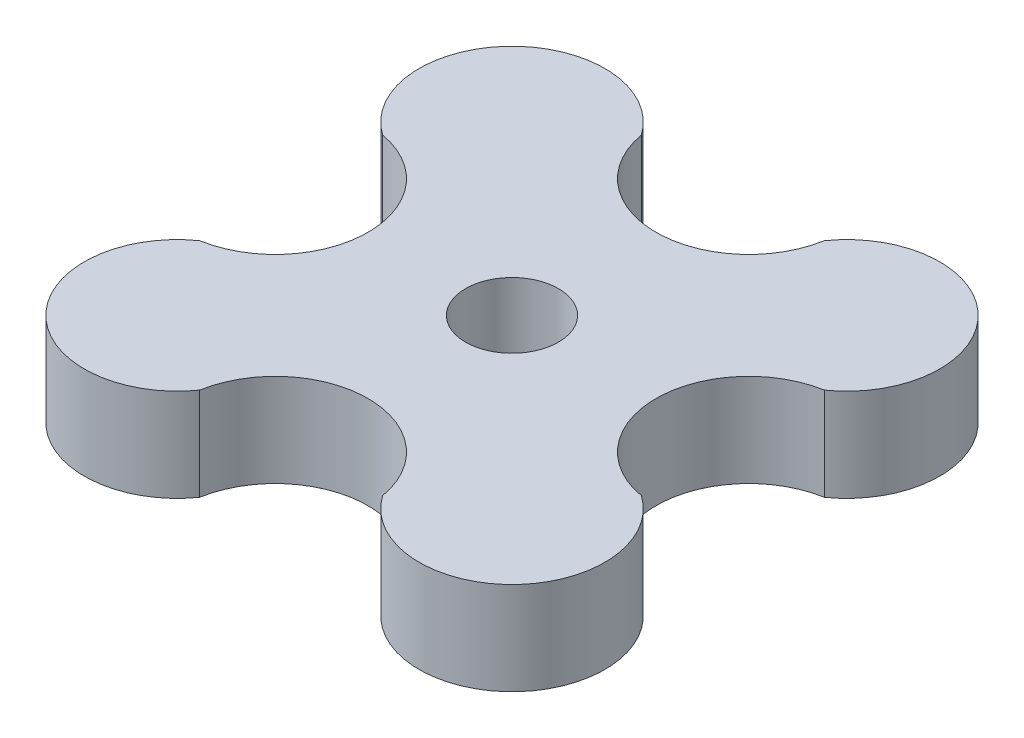
ISO-10303-21;
HEADER;
FILE_DESCRIPTION(('STEP AP214'),'2;1');
FILE_NAME('part.step','',(''),(''),'','','');
FILE_SCHEMA(('AUTOMOTIVE_DESIGN { 1 0 10303 214 1 1 1 1 }'));
ENDSEC;
DATA;
#1=APPLICATION_CONTEXT('core data for automotive mechanical design processes');
#2=APPLICATION_PROTOCOL_DEFINITION('international standard','automotive_design',2000,#1);
#3=PRODUCT_CONTEXT('',#1,'mechanical');
#4=PRODUCT('Part','Part','',(#3));
#5=PRODUCT_RELATED_PRODUCT_CATEGORY('part','',(#4));
#6=PRODUCT_DEFINITION_FORMATION('','',#4);
#7=PRODUCT_DEFINITION_CONTEXT('part definition',#1,'design');
#8=PRODUCT_DEFINITION('design','',#6,#7);
#9=PRODUCT_DEFINITION_SHAPE('','',#8);
#10=(LENGTH_UNIT() NAMED_UNIT(*) SI_UNIT(.MILLI.,.METRE.));
#11=(NAMED_UNIT(*) PLANE_ANGLE_UNIT() SI_UNIT($,.RADIAN.));
#12=(NAMED_UNIT(*) SI_UNIT($,.STERADIAN.) SOLID_ANGLE_UNIT());
#13=UNCERTAINTY_MEASURE_WITH_UNIT(LENGTH_MEASURE(1.E-05),#10,'distance_accuracy_value','');
#14=(GEOMETRIC_REPRESENTATION_CONTEXT(3) GLOBAL_UNCERTAINTY_ASSIGNED_CONTEXT((#13)) GLOBAL_UNIT_ASSIGNED_CONTEXT((#10,
#11,#12)) REPRESENTATION_CONTEXT('',''));
#15=CARTESIAN_POINT('',(0.,0.,0.));
#16=DIRECTION('',(0.,0.,1.));
#17=DIRECTION('',(1.,0.,0.));
#18=AXIS2_PLACEMENT_3D('',#15,#16,#17);
#19=CARTESIAN_POINT('',(0.,5.,-12.75));
#20=DIRECTION('',(0.,-1.,0.));
#21=DIRECTION('',(0.,0.,-1.));
#22=AXIS2_PLACEMENT_3D('',#19,#20,#21);
#23=CYLINDRICAL_SURFACE('',#22,5.);
#24=CARTESIAN_POINT('',(0.,0.,-12.75));
#25=DIRECTION('',(0.,1.,0.));
#26=DIRECTION('',(0.,0.,1.));
#27=AXIS2_PLACEMENT_3D('',#24,#25,#26);
#28=CIRCLE('',#27,5.);
#29=CARTESIAN_POINT('',(-4.9258377784617,0.,-11.8920243708126));
#30=VERTEX_POINT('',#29);
#31=CARTESIAN_POINT('',(4.92583777846162,0.,-11.8920243708121));
#32=VERTEX_POINT('',#31);
#33=EDGE_CURVE('E138',#30,#32,#28,.T.);
#34=ORIENTED_EDGE('',*,*,#33,.F.);
#35=DIRECTION('',(0.,-1.,0.));
#36=VECTOR('',#35,1.);
#37=CARTESIAN_POINT('',(-4.9258377784617,5.,-11.8920243708126));
#38=LINE('',#37,#36);
#39=CARTESIAN_POINT('',(-4.9258377784617,5.,-11.8920243708126));
#40=VERTEX_POINT('',#39);
#41=EDGE_CURVE('E11',#40,#30,#38,.T.);
#42=ORIENTED_EDGE('',*,*,#41,.F.);
#43=CARTESIAN_POINT('',(0.,5.,-12.75));
#44=DIRECTION('',(0.,1.,0.));
#45=DIRECTION('',(0.,0.,1.));
#46=AXIS2_PLACEMENT_3D('',#43,#44,#45);
#47=CIRCLE('',#46,5.);
#48=CARTESIAN_POINT('',(4.92583777846162,5.,-11.8920243708121));
#49=VERTEX_POINT('',#48);
#50=EDGE_CURVE('E159',#40,#49,#47,.T.);
#51=ORIENTED_EDGE('',*,*,#50,.T.);
#52=DIRECTION('',(0.,-1.,0.));
#53=VECTOR('',#52,1.);
#54=CARTESIAN_POINT('',(4.92583777846162,5.,-11.8920243708121));
#55=LINE('',#54,#53);
#56=EDGE_CURVE('E95',#49,#32,#55,.T.);
#57=ORIENTED_EDGE('',*,*,#56,.T.);
#58=EDGE_LOOP('',(#34,#42,#51,#57));
#59=FACE_BOUND('',#58,.T.);
#60=ADVANCED_FACE('F45',(#59),#23,.F.);
#61=CARTESIAN_POINT('',(-9.01561146012822,5.,-9.01561146012784));
#62=DIRECTION('',(0.,-1.,0.));
#63=DIRECTION('',(0.,0.,-1.));
#64=AXIS2_PLACEMENT_3D('',#61,#62,#63);
#65=CYLINDRICAL_SURFACE('',#64,5.00000000000059);
#66=CARTESIAN_POINT('',(-9.01561146012822,0.,-9.01561146012784));
#67=DIRECTION('',(0.,1.,0.));
#68=DIRECTION('',(0.,0.,1.));
#69=AXIS2_PLACEMENT_3D('',#66,#67,#68);
#70=CIRCLE('',#69,5.00000000000059);
#71=CARTESIAN_POINT('',(-11.8920243708148,0.,-4.92583777846261));
#72=VERTEX_POINT('',#71);
#73=EDGE_CURVE('E141',#30,#72,#70,.T.);
#74=ORIENTED_EDGE('',*,*,#73,.T.);
#75=DIRECTION('',(0.,-1.,0.));
#76=VECTOR('',#75,1.);
#77=CARTESIAN_POINT('',(-11.8920243708148,5.,-4.92583777846261));
#78=LINE('',#77,#76);
#79=CARTESIAN_POINT('',(-11.8920243708148,5.,-4.92583777846261));
#80=VERTEX_POINT('',#79);
#81=EDGE_CURVE('E53',#80,#72,#78,.T.);
#82=ORIENTED_EDGE('',*,*,#81,.F.);
#83=CARTESIAN_POINT('',(-9.01561146012822,5.,-9.01561146012784));
#84=DIRECTION('',(0.,1.,0.));
#85=DIRECTION('',(0.,0.,1.));
#86=AXIS2_PLACEMENT_3D('',#83,#84,#85);
#87=CIRCLE('',#86,5.00000000000059);
#88=EDGE_CURVE('E186',#40,#80,#87,.T.);
#89=ORIENTED_EDGE('',*,*,#88,.F.);
#90=ORIENTED_EDGE('',*,*,#41,.T.);
#91=EDGE_LOOP('',(#74,#82,#89,#90));
#92=FACE_BOUND('',#91,.T.);
#93=ADVANCED_FACE('F175',(#92),#65,.T.);
#94=CARTESIAN_POINT('',(-12.7499999999991,5.,9.05161275759671E-13));
#95=DIRECTION('',(0.,-1.,0.));
#96=DIRECTION('',(0.,0.,-1.));
#97=AXIS2_PLACEMENT_3D('',#94,#95,#96);
#98=CYLINDRICAL_SURFACE('',#97,5.00000000000126);
#99=CARTESIAN_POINT('',(-12.7499999999991,0.,9.05161275759671E-13));
#100=DIRECTION('',(0.,1.,0.));
#101=DIRECTION('',(0.,0.,1.));
#102=AXIS2_PLACEMENT_3D('',#99,#100,#101);
#103=CIRCLE('',#102,5.00000000000126);
#104=CARTESIAN_POINT('',(-11.8920243708168,0.,4.92583777846477));
#105=VERTEX_POINT('',#104);
#106=EDGE_CURVE('E145',#105,#72,#103,.T.);
#107=ORIENTED_EDGE('',*,*,#106,.F.);
#108=DIRECTION('',(0.,-1.,0.));
#109=VECTOR('',#108,1.);
#110=CARTESIAN_POINT('',(-11.8920243708168,5.,4.92583777846477));
#111=LINE('',#110,#109);
#112=CARTESIAN_POINT('',(-11.8920243708168,5.,4.92583777846477));
#113=VERTEX_POINT('',#112);
#114=EDGE_CURVE('E165',#113,#105,#111,.T.);
#115=ORIENTED_EDGE('',*,*,#114,.F.);
#116=CARTESIAN_POINT('',(-12.7499999999991,5.,9.05161275759671E-13));
#117=DIRECTION('',(0.,1.,0.));
#118=DIRECTION('',(0.,0.,1.));
#119=AXIS2_PLACEMENT_3D('',#116,#117,#118);
#120=CIRCLE('',#119,5.00000000000126);
#121=EDGE_CURVE('E172',#113,#80,#120,.T.);
#122=ORIENTED_EDGE('',*,*,#121,.T.);
#123=ORIENTED_EDGE('',*,*,#81,.T.);
#124=EDGE_LOOP('',(#107,#115,#122,#123));
#125=FACE_BOUND('',#124,.T.);
#126=ADVANCED_FACE('F170',(#125),#98,.F.);
#127=CARTESIAN_POINT('',(-9.01561146012694,5.,9.01561146012912));
#128=DIRECTION('',(0.,-1.,0.));
#129=DIRECTION('',(0.,0.,-1.));
#130=AXIS2_PLACEMENT_3D('',#127,#128,#129);
#131=CYLINDRICAL_SURFACE('',#130,5.00000000000177);
#132=CARTESIAN_POINT('',(-9.01561146012694,0.,9.01561146012912));
#133=DIRECTION('',(0.,1.,0.));
#134=DIRECTION('',(0.,0.,1.));
#135=AXIS2_PLACEMENT_3D('',#132,#133,#134);
#136=CIRCLE('',#135,5.00000000000177);
#137=CARTESIAN_POINT('',(-4.92583777846293,0.,11.8920243708195));
#138=VERTEX_POINT('',#137);
#139=EDGE_CURVE('E148',#105,#138,#136,.T.);
#140=ORIENTED_EDGE('',*,*,#139,.T.);
#141=DIRECTION('',(0.,-1.,0.));
#142=VECTOR('',#141,1.);
#143=CARTESIAN_POINT('',(-4.92583777846293,5.,11.8920243708195));
#144=LINE('',#143,#142);
#145=CARTESIAN_POINT('',(-4.92583777846293,5.,11.8920243708195));
#146=VERTEX_POINT('',#145);
#147=EDGE_CURVE('E163',#146,#138,#144,.T.);
#148=ORIENTED_EDGE('',*,*,#147,.F.);
#149=CARTESIAN_POINT('',(-9.01561146012694,5.,9.01561146012912));
#150=DIRECTION('',(0.,1.,0.));
#151=DIRECTION('',(0.,0.,1.));
#152=AXIS2_PLACEMENT_3D('',#149,#150,#151);
#153=CIRCLE('',#152,5.00000000000177);
#154=EDGE_CURVE('E184',#113,#146,#153,.T.);
#155=ORIENTED_EDGE('',*,*,#154,.F.);
#156=ORIENTED_EDGE('',*,*,#114,.T.);
#157=EDGE_LOOP('',(#140,#148,#155,#156));
#158=FACE_BOUND('',#157,.T.);
#159=ADVANCED_FACE('F182',(#158),#131,.T.);
#160=CARTESIAN_POINT('',(1.80719970218152E-12,5.,12.75));
#161=DIRECTION('',(0.,-1.,0.));
#162=DIRECTION('',(0.,0.,-1.));
#163=AXIS2_PLACEMENT_3D('',#160,#161,#162);
#164=CYLINDRICAL_SURFACE('',#163,5.00000000000182);
#165=CARTESIAN_POINT('',(1.80719970218152E-12,0.,12.75));
#166=DIRECTION('',(0.,1.,0.));
#167=DIRECTION('',(0.,0.,1.));
#168=AXIS2_PLACEMENT_3D('',#165,#166,#167);
#169=CIRCLE('',#168,5.00000000000182);
#170=CARTESIAN_POINT('',(4.92583777846626,0.,11.8920243708178));
#171=VERTEX_POINT('',#170);
#172=EDGE_CURVE('E151',#171,#138,#169,.T.);
#173=ORIENTED_EDGE('',*,*,#172,.F.);
#174=DIRECTION('',(0.,-1.,0.));
#175=VECTOR('',#174,1.);
#176=CARTESIAN_POINT('',(4.92583777846626,5.,11.8920243708178));
#177=LINE('',#176,#175);
#178=CARTESIAN_POINT('',(4.92583777846626,5.,11.8920243708178));
#179=VERTEX_POINT('',#178);
#180=EDGE_CURVE('E131',#179,#171,#177,.T.);
#181=ORIENTED_EDGE('',*,*,#180,.F.);
#182=CARTESIAN_POINT('',(1.80719970218152E-12,5.,12.75));
#183=DIRECTION('',(0.,1.,0.));
#184=DIRECTION('',(0.,0.,1.));
#185=AXIS2_PLACEMENT_3D('',#182,#183,#184);
#186=CIRCLE('',#185,5.00000000000182);
#187=EDGE_CURVE('E120',#179,#146,#186,.T.);
#188=ORIENTED_EDGE('',*,*,#187,.T.);
#189=ORIENTED_EDGE('',*,*,#147,.T.);
#190=EDGE_LOOP('',(#173,#181,#188,#189));
#191=FACE_BOUND('',#190,.T.);
#192=ADVANCED_FACE('F191',(#191),#164,.F.);
#193=CARTESIAN_POINT('',(9.01561146013002,5.,9.01561146012784));
#194=DIRECTION('',(0.,-1.,0.));
#195=DIRECTION('',(0.,0.,-1.));
#196=AXIS2_PLACEMENT_3D('',#193,#194,#195);
#197=CYLINDRICAL_SURFACE('',#196,5.00000000000135);
#198=CARTESIAN_POINT('',(9.01561146013002,0.,9.01561146012784));
#199=DIRECTION('',(0.,1.,0.));
#200=DIRECTION('',(0.,0.,1.));
#201=AXIS2_PLACEMENT_3D('',#198,#199,#200);
#202=CIRCLE('',#201,5.00000000000135);
#203=CARTESIAN_POINT('',(11.8920243708172,0.,4.92583777846209));
#204=VERTEX_POINT('',#203);
#205=EDGE_CURVE('E127',#171,#204,#202,.T.);
#206=ORIENTED_EDGE('',*,*,#205,.T.);
#207=DIRECTION('',(0.,-1.,0.));
#208=VECTOR('',#207,1.);
#209=CARTESIAN_POINT('',(11.8920243708172,5.,4.92583777846209));
#210=LINE('',#209,#208);
#211=CARTESIAN_POINT('',(11.8920243708172,5.,4.92583777846209));
#212=VERTEX_POINT('',#211);
#213=EDGE_CURVE('E124',#212,#204,#210,.T.);
#214=ORIENTED_EDGE('',*,*,#213,.F.);
#215=CARTESIAN_POINT('',(9.01561146013002,5.,9.01561146012784));
#216=DIRECTION('',(0.,1.,0.));
#217=DIRECTION('',(0.,0.,1.));
#218=AXIS2_PLACEMENT_3D('',#215,#216,#217);
#219=CIRCLE('',#218,5.00000000000135);
#220=EDGE_CURVE('E114',#179,#212,#219,.T.);
#221=ORIENTED_EDGE('',*,*,#220,.F.);
#222=ORIENTED_EDGE('',*,*,#180,.T.);
#223=EDGE_LOOP('',(#206,#214,#221,#222));
#224=FACE_BOUND('',#223,.T.);
#225=ADVANCED_FACE('F125',(#224),#197,.T.);
#226=CARTESIAN_POINT('',(12.7500000000009,5.,-9.03599851090759E-13));
#227=DIRECTION('',(0.,-1.,0.));
#228=DIRECTION('',(0.,0.,-1.));
#229=AXIS2_PLACEMENT_3D('',#226,#227,#228);
#230=CYLINDRICAL_SURFACE('',#229,5.00000000000065);
#231=CARTESIAN_POINT('',(12.7500000000009,0.,-9.03599851090759E-13));
#232=DIRECTION('',(0.,1.,0.));
#233=DIRECTION('',(0.,0.,1.));
#234=AXIS2_PLACEMENT_3D('',#231,#232,#233);
#235=CIRCLE('',#234,5.00000000000065);
#236=CARTESIAN_POINT('',(11.8920243708136,0.,-4.92583777846327));
#237=VERTEX_POINT('',#236);
#238=EDGE_CURVE('E155',#237,#204,#235,.T.);
#239=ORIENTED_EDGE('',*,*,#238,.F.);
#240=DIRECTION('',(0.,-1.,0.));
#241=VECTOR('',#240,1.);
#242=CARTESIAN_POINT('',(11.8920243708136,5.,-4.92583777846327));
#243=LINE('',#242,#241);
#244=CARTESIAN_POINT('',(11.8920243708136,5.,-4.92583777846327));
#245=VERTEX_POINT('',#244);
#246=EDGE_CURVE('E88',#245,#237,#243,.T.);
#247=ORIENTED_EDGE('',*,*,#246,.F.);
#248=CARTESIAN_POINT('',(12.7500000000009,5.,-9.03599851090759E-13));
#249=DIRECTION('',(0.,1.,0.));
#250=DIRECTION('',(0.,0.,1.));
#251=AXIS2_PLACEMENT_3D('',#248,#249,#250);
#252=CIRCLE('',#251,5.00000000000065);
#253=EDGE_CURVE('E118',#245,#212,#252,.T.);
#254=ORIENTED_EDGE('',*,*,#253,.T.);
#255=ORIENTED_EDGE('',*,*,#213,.T.);
#256=EDGE_LOOP('',(#239,#247,#254,#255));
#257=FACE_BOUND('',#256,.T.);
#258=ADVANCED_FACE('F133',(#257),#230,.F.);
#259=CARTESIAN_POINT('',(9.01561146012874,5.,-9.01561146012912));
#260=DIRECTION('',(0.,-1.,0.));
#261=DIRECTION('',(0.,0.,-1.));
#262=AXIS2_PLACEMENT_3D('',#259,#260,#261);
#263=CYLINDRICAL_SURFACE('',#262,5.00000000000009);
#264=CARTESIAN_POINT('',(9.01561146012874,0.,-9.01561146012912));
#265=DIRECTION('',(0.,1.,0.));
#266=DIRECTION('',(0.,0.,1.));
#267=AXIS2_PLACEMENT_3D('',#264,#265,#266);
#268=CIRCLE('',#267,5.00000000000009);
#269=EDGE_CURVE('E157',#237,#32,#268,.T.);
#270=ORIENTED_EDGE('',*,*,#269,.T.);
#271=ORIENTED_EDGE('',*,*,#56,.F.);
#272=CARTESIAN_POINT('',(9.01561146012874,5.,-9.01561146012912));
#273=DIRECTION('',(0.,1.,0.));
#274=DIRECTION('',(0.,0.,1.));
#275=AXIS2_PLACEMENT_3D('',#272,#273,#274);
#276=CIRCLE('',#275,5.00000000000009);
#277=EDGE_CURVE('E61',#245,#49,#276,.T.);
#278=ORIENTED_EDGE('',*,*,#277,.F.);
#279=ORIENTED_EDGE('',*,*,#246,.T.);
#280=EDGE_LOOP('',(#270,#271,#278,#279));
#281=FACE_BOUND('',#280,.T.);
#282=ADVANCED_FACE('F192',(#281),#263,.T.);
#283=CARTESIAN_POINT('',(0.,5.,0.));
#284=DIRECTION('',(0.,1.,0.));
#285=DIRECTION('',(0.,0.,1.));
#286=AXIS2_PLACEMENT_3D('',#283,#284,#285);
#287=PLANE('',#286);
#288=CARTESIAN_POINT('',(0.,5.,0.));
#289=DIRECTION('',(0.,1.,0.));
#290=DIRECTION('',(0.,0.,1.));
#291=AXIS2_PLACEMENT_3D('',#288,#289,#290);
#292=CIRCLE('',#291,2.5);
#293=CARTESIAN_POINT('',(0.,5.,2.5));
#294=VERTEX_POINT('',#293);
#295=EDGE_CURVE('E194',#294,#294,#292,.T.);
#296=ORIENTED_EDGE('',*,*,#295,.F.);
#297=EDGE_LOOP('',(#296));
#298=FACE_BOUND('',#297,.T.);
#299=ORIENTED_EDGE('',*,*,#50,.F.);
#300=ORIENTED_EDGE('',*,*,#88,.T.);
#301=ORIENTED_EDGE('',*,*,#121,.F.);
#302=ORIENTED_EDGE('',*,*,#154,.T.);
#303=ORIENTED_EDGE('',*,*,#187,.F.);
#304=ORIENTED_EDGE('',*,*,#220,.T.);
#305=ORIENTED_EDGE('',*,*,#253,.F.);
#306=ORIENTED_EDGE('',*,*,#277,.T.);
#307=EDGE_LOOP('',(#299,#300,#301,#302,#303,#304,#305,#306));
#308=FACE_BOUND('',#307,.T.);
#309=ADVANCED_FACE('F116',(#298,#308),#287,.T.);
#310=CARTESIAN_POINT('',(0.,0.,0.));
#311=DIRECTION('',(0.,1.,0.));
#312=DIRECTION('',(0.,0.,1.));
#313=AXIS2_PLACEMENT_3D('',#310,#311,#312);
#314=PLANE('',#313);
#315=CARTESIAN_POINT('',(0.,0.,0.));
#316=DIRECTION('',(0.,1.,0.));
#317=DIRECTION('',(0.,0.,1.));
#318=AXIS2_PLACEMENT_3D('',#315,#316,#317);
#319=CIRCLE('',#318,2.5);
#320=CARTESIAN_POINT('',(0.,0.,2.5));
#321=VERTEX_POINT('',#320);
#322=EDGE_CURVE('E142',#321,#321,#319,.T.);
#323=ORIENTED_EDGE('',*,*,#322,.T.);
#324=EDGE_LOOP('',(#323));
#325=FACE_BOUND('',#324,.T.);
#326=ORIENTED_EDGE('',*,*,#33,.T.);
#327=ORIENTED_EDGE('',*,*,#269,.F.);
#328=ORIENTED_EDGE('',*,*,#238,.T.);
#329=ORIENTED_EDGE('',*,*,#205,.F.);
#330=ORIENTED_EDGE('',*,*,#172,.T.);
#331=ORIENTED_EDGE('',*,*,#139,.F.);
#332=ORIENTED_EDGE('',*,*,#106,.T.);
#333=ORIENTED_EDGE('',*,*,#73,.F.);
#334=EDGE_LOOP('',(#326,#327,#328,#329,#330,#331,#332,#333));
#335=FACE_BOUND('',#334,.T.);
#336=ADVANCED_FACE('F178',(#325,#335),#314,.F.);
#337=CARTESIAN_POINT('',(0.,0.,0.));
#338=DIRECTION('',(0.,1.,0.));
#339=DIRECTION('',(0.,0.,1.));
#340=AXIS2_PLACEMENT_3D('',#337,#338,#339);
#341=CYLINDRICAL_SURFACE('',#340,2.5);
#342=ORIENTED_EDGE('',*,*,#322,.F.);
#343=EDGE_LOOP('',(#342));
#344=FACE_BOUND('',#343,.T.);
#345=ORIENTED_EDGE('',*,*,#295,.T.);
#346=EDGE_LOOP('',(#345));
#347=FACE_BOUND('',#346,.T.);
#348=ADVANCED_FACE('F201',(#344,#347),#341,.F.);
#349=CLOSED_SHELL('',(#60,#93,#126,#159,#192,#225,#258,#282,#309,#336,#348));
#350=MANIFOLD_SOLID_BREP('B2',#349);
#351=ADVANCED_BREP_SHAPE_REPRESENTATION('',(#18,#350),#14);
#352=SHAPE_DEFINITION_REPRESENTATION(#9,#351);
ENDSEC;
END-ISO-10303-21;
